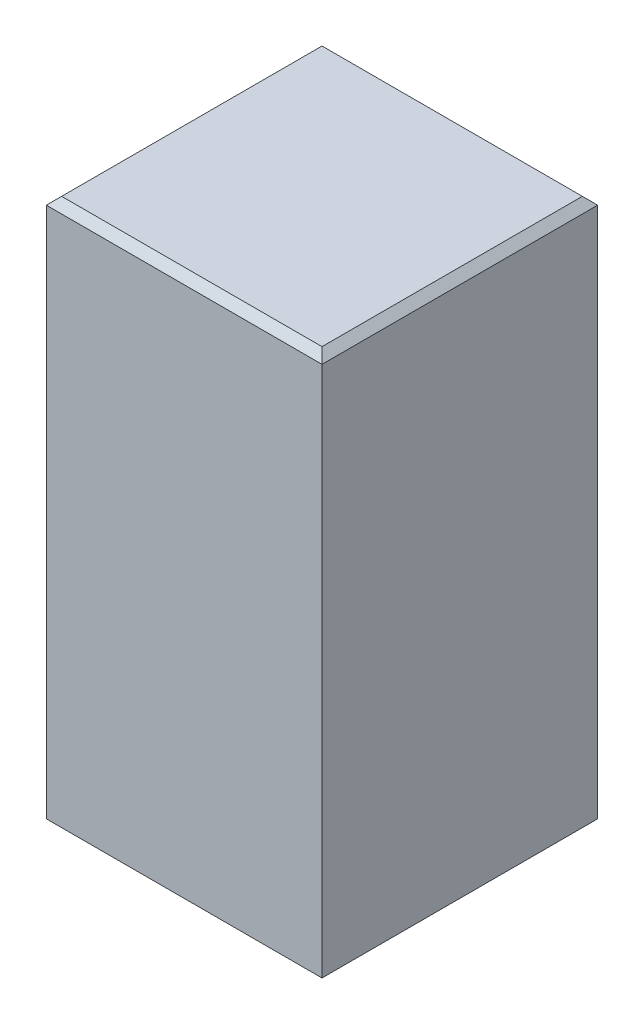
ISO-10303-21;
HEADER;
FILE_DESCRIPTION(('STEP AP214'),'2;1');
FILE_NAME('part.step','',(''),(''),'','','');
FILE_SCHEMA(('AUTOMOTIVE_DESIGN { 1 0 10303 214 1 1 1 1 }'));
ENDSEC;
DATA;
#1=APPLICATION_CONTEXT('core data for automotive mechanical design processes');
#2=APPLICATION_PROTOCOL_DEFINITION('international standard','automotive_design',2000,#1);
#3=PRODUCT_CONTEXT('',#1,'mechanical');
#4=PRODUCT('Part','Part','',(#3));
#5=PRODUCT_RELATED_PRODUCT_CATEGORY('part','',(#4));
#6=PRODUCT_DEFINITION_FORMATION('','',#4);
#7=PRODUCT_DEFINITION_CONTEXT('part definition',#1,'design');
#8=PRODUCT_DEFINITION('design','',#6,#7);
#9=PRODUCT_DEFINITION_SHAPE('','',#8);
#10=(LENGTH_UNIT() NAMED_UNIT(*) SI_UNIT(.MILLI.,.METRE.));
#11=(NAMED_UNIT(*) PLANE_ANGLE_UNIT() SI_UNIT($,.RADIAN.));
#12=(NAMED_UNIT(*) SI_UNIT($,.STERADIAN.) SOLID_ANGLE_UNIT());
#13=UNCERTAINTY_MEASURE_WITH_UNIT(LENGTH_MEASURE(1.E-05),#10,'distance_accuracy_value','');
#14=(GEOMETRIC_REPRESENTATION_CONTEXT(3) GLOBAL_UNCERTAINTY_ASSIGNED_CONTEXT((#13)) GLOBAL_UNIT_ASSIGNED_CONTEXT((#10,
#11,#12)) REPRESENTATION_CONTEXT('',''));
#15=CARTESIAN_POINT('',(0.,0.,0.));
#16=DIRECTION('',(0.,0.,1.));
#17=DIRECTION('',(1.,0.,0.));
#18=AXIS2_PLACEMENT_3D('',#15,#16,#17);
#19=CARTESIAN_POINT('',(0.,0.,0.));
#20=DIRECTION('',(0.,1.,0.));
#21=DIRECTION('',(0.,0.,1.));
#22=AXIS2_PLACEMENT_3D('',#19,#20,#21);
#23=PLANE('',#22);
#24=DIRECTION('',(0.,0.,1.));
#25=VECTOR('',#24,1.);
#26=CARTESIAN_POINT('',(-9.,0.,-9.));
#27=LINE('',#26,#25);
#28=CARTESIAN_POINT('',(-9.,0.,-9.));
#29=VERTEX_POINT('',#28);
#30=CARTESIAN_POINT('',(-9.,0.,9.));
#31=VERTEX_POINT('',#30);
#32=EDGE_CURVE('E148',#29,#31,#27,.T.);
#33=ORIENTED_EDGE('',*,*,#32,.F.);
#34=DIRECTION('',(-1.,0.,0.));
#35=VECTOR('',#34,1.);
#36=CARTESIAN_POINT('',(-9.,0.,-9.));
#37=LINE('',#36,#35);
#38=CARTESIAN_POINT('',(9.,0.,-9.));
#39=VERTEX_POINT('',#38);
#40=EDGE_CURVE('E165',#39,#29,#37,.T.);
#41=ORIENTED_EDGE('',*,*,#40,.F.);
#42=DIRECTION('',(0.,0.,-1.));
#43=VECTOR('',#42,1.);
#44=CARTESIAN_POINT('',(9.,0.,-9.));
#45=LINE('',#44,#43);
#46=CARTESIAN_POINT('',(9.00000000000001,0.,9.));
#47=VERTEX_POINT('',#46);
#48=EDGE_CURVE('E161',#47,#39,#45,.T.);
#49=ORIENTED_EDGE('',*,*,#48,.F.);
#50=DIRECTION('',(1.,0.,0.));
#51=VECTOR('',#50,1.);
#52=CARTESIAN_POINT('',(-9.,0.,9.));
#53=LINE('',#52,#51);
#54=EDGE_CURVE('E157',#31,#47,#53,.T.);
#55=ORIENTED_EDGE('',*,*,#54,.F.);
#56=EDGE_LOOP('',(#33,#41,#49,#55));
#57=FACE_BOUND('',#56,.T.);
#58=DIRECTION('',(0.,0.,1.));
#59=VECTOR('',#58,1.);
#60=CARTESIAN_POINT('',(-8.2,0.,-8.2));
#61=LINE('',#60,#59);
#62=CARTESIAN_POINT('',(-8.2,0.,-8.2));
#63=VERTEX_POINT('',#62);
#64=CARTESIAN_POINT('',(-8.19999999999999,0.,8.2));
#65=VERTEX_POINT('',#64);
#66=EDGE_CURVE('E216',#63,#65,#61,.T.);
#67=ORIENTED_EDGE('',*,*,#66,.T.);
#68=DIRECTION('',(1.,0.,0.));
#69=VECTOR('',#68,1.);
#70=CARTESIAN_POINT('',(-8.19999999999999,0.,8.2));
#71=LINE('',#70,#69);
#72=CARTESIAN_POINT('',(8.2,0.,8.2));
#73=VERTEX_POINT('',#72);
#74=EDGE_CURVE('E222',#65,#73,#71,.T.);
#75=ORIENTED_EDGE('',*,*,#74,.T.);
#76=DIRECTION('',(0.,0.,-1.));
#77=VECTOR('',#76,1.);
#78=CARTESIAN_POINT('',(8.2,0.,-8.2));
#79=LINE('',#78,#77);
#80=CARTESIAN_POINT('',(8.2,0.,-8.2));
#81=VERTEX_POINT('',#80);
#82=EDGE_CURVE('E141',#73,#81,#79,.T.);
#83=ORIENTED_EDGE('',*,*,#82,.T.);
#84=DIRECTION('',(-1.,0.,0.));
#85=VECTOR('',#84,1.);
#86=CARTESIAN_POINT('',(-8.2,0.,-8.2));
#87=LINE('',#86,#85);
#88=EDGE_CURVE('E232',#81,#63,#87,.T.);
#89=ORIENTED_EDGE('',*,*,#88,.T.);
#90=EDGE_LOOP('',(#67,#75,#83,#89));
#91=FACE_BOUND('',#90,.T.);
#92=ADVANCED_FACE('F39',(#57,#91),#23,.F.);
#93=CARTESIAN_POINT('',(-9.,34.,-9.));
#94=DIRECTION('',(1.,0.,0.));
#95=DIRECTION('',(0.,0.,-1.));
#96=AXIS2_PLACEMENT_3D('',#93,#94,#95);
#97=PLANE('',#96);
#98=DIRECTION('',(0.,-1.,0.));
#99=VECTOR('',#98,1.);
#100=CARTESIAN_POINT('',(-9.,34.,9.));
#101=LINE('',#100,#99);
#102=CARTESIAN_POINT('',(-9.,34.7,9.));
#103=VERTEX_POINT('',#102);
#104=EDGE_CURVE('E178',#103,#31,#101,.T.);
#105=ORIENTED_EDGE('',*,*,#104,.F.);
#106=DIRECTION('',(0.,0.,-1.));
#107=VECTOR('',#106,1.);
#108=CARTESIAN_POINT('',(-9.,34.7,-9.));
#109=LINE('',#108,#107);
#110=CARTESIAN_POINT('',(-9.,34.7,-9.));
#111=VERTEX_POINT('',#110);
#112=EDGE_CURVE('E194',#103,#111,#109,.T.);
#113=ORIENTED_EDGE('',*,*,#112,.T.);
#114=DIRECTION('',(0.,-1.,0.));
#115=VECTOR('',#114,1.);
#116=CARTESIAN_POINT('',(-9.,34.,-9.));
#117=LINE('',#116,#115);
#118=EDGE_CURVE('E169',#111,#29,#117,.T.);
#119=ORIENTED_EDGE('',*,*,#118,.T.);
#120=ORIENTED_EDGE('',*,*,#32,.T.);
#121=EDGE_LOOP('',(#105,#113,#119,#120));
#122=FACE_BOUND('',#121,.T.);
#123=ADVANCED_FACE('F257',(#122),#97,.F.);
#124=CARTESIAN_POINT('',(-9.,34.,9.));
#125=DIRECTION('',(0.,0.,-1.));
#126=DIRECTION('',(-1.,0.,0.));
#127=AXIS2_PLACEMENT_3D('',#124,#125,#126);
#128=PLANE('',#127);
#129=DIRECTION('',(0.,-1.,0.));
#130=VECTOR('',#129,1.);
#131=CARTESIAN_POINT('',(9.00000000000001,34.,9.));
#132=LINE('',#131,#130);
#133=CARTESIAN_POINT('',(9.00000000000001,34.7,9.));
#134=VERTEX_POINT('',#133);
#135=EDGE_CURVE('E175',#134,#47,#132,.T.);
#136=ORIENTED_EDGE('',*,*,#135,.F.);
#137=DIRECTION('',(-1.,0.,0.));
#138=VECTOR('',#137,1.);
#139=CARTESIAN_POINT('',(-9.,34.7,9.));
#140=LINE('',#139,#138);
#141=EDGE_CURVE('E11',#134,#103,#140,.T.);
#142=ORIENTED_EDGE('',*,*,#141,.T.);
#143=ORIENTED_EDGE('',*,*,#104,.T.);
#144=ORIENTED_EDGE('',*,*,#54,.T.);
#145=EDGE_LOOP('',(#136,#142,#143,#144));
#146=FACE_BOUND('',#145,.T.);
#147=ADVANCED_FACE('F262',(#146),#128,.F.);
#148=CARTESIAN_POINT('',(9.,34.,-9.));
#149=DIRECTION('',(-1.,0.,0.));
#150=DIRECTION('',(0.,0.,1.));
#151=AXIS2_PLACEMENT_3D('',#148,#149,#150);
#152=PLANE('',#151);
#153=DIRECTION('',(0.,-1.,0.));
#154=VECTOR('',#153,1.);
#155=CARTESIAN_POINT('',(9.,34.,-9.));
#156=LINE('',#155,#154);
#157=CARTESIAN_POINT('',(9.,34.7,-9.));
#158=VERTEX_POINT('',#157);
#159=EDGE_CURVE('E172',#158,#39,#156,.T.);
#160=ORIENTED_EDGE('',*,*,#159,.F.);
#161=DIRECTION('',(0.,0.,1.));
#162=VECTOR('',#161,1.);
#163=CARTESIAN_POINT('',(9.00000000000001,34.7,9.));
#164=LINE('',#163,#162);
#165=EDGE_CURVE('E49',#158,#134,#164,.T.);
#166=ORIENTED_EDGE('',*,*,#165,.T.);
#167=ORIENTED_EDGE('',*,*,#135,.T.);
#168=ORIENTED_EDGE('',*,*,#48,.T.);
#169=EDGE_LOOP('',(#160,#166,#167,#168));
#170=FACE_BOUND('',#169,.T.);
#171=ADVANCED_FACE('F253',(#170),#152,.F.);
#172=CARTESIAN_POINT('',(-9.,34.,-9.));
#173=DIRECTION('',(0.,0.,1.));
#174=DIRECTION('',(1.,0.,0.));
#175=AXIS2_PLACEMENT_3D('',#172,#173,#174);
#176=PLANE('',#175);
#177=ORIENTED_EDGE('',*,*,#118,.F.);
#178=DIRECTION('',(1.,0.,0.));
#179=VECTOR('',#178,1.);
#180=CARTESIAN_POINT('',(9.00000000000001,34.7,-9.));
#181=LINE('',#180,#179);
#182=EDGE_CURVE('E64',#111,#158,#181,.T.);
#183=ORIENTED_EDGE('',*,*,#182,.T.);
#184=ORIENTED_EDGE('',*,*,#159,.T.);
#185=ORIENTED_EDGE('',*,*,#40,.T.);
#186=EDGE_LOOP('',(#177,#183,#184,#185));
#187=FACE_BOUND('',#186,.T.);
#188=ADVANCED_FACE('F246',(#187),#176,.F.);
#189=CARTESIAN_POINT('',(-8.2,34.,-8.2));
#190=DIRECTION('',(1.,0.,0.));
#191=DIRECTION('',(0.,0.,-1.));
#192=AXIS2_PLACEMENT_3D('',#189,#190,#191);
#193=PLANE('',#192);
#194=ORIENTED_EDGE('',*,*,#66,.F.);
#195=DIRECTION('',(0.,-1.,0.));
#196=VECTOR('',#195,1.);
#197=CARTESIAN_POINT('',(-8.2,34.,-8.2));
#198=LINE('',#197,#196);
#199=CARTESIAN_POINT('',(-8.2,34.,-8.2));
#200=VERTEX_POINT('',#199);
#201=EDGE_CURVE('E150',#200,#63,#198,.T.);
#202=ORIENTED_EDGE('',*,*,#201,.F.);
#203=DIRECTION('',(0.,0.,1.));
#204=VECTOR('',#203,1.);
#205=CARTESIAN_POINT('',(-8.2,34.,-8.2));
#206=LINE('',#205,#204);
#207=CARTESIAN_POINT('',(-8.19999999999999,34.,8.2));
#208=VERTEX_POINT('',#207);
#209=EDGE_CURVE('E137',#200,#208,#206,.T.);
#210=ORIENTED_EDGE('',*,*,#209,.T.);
#211=DIRECTION('',(0.,-1.,0.));
#212=VECTOR('',#211,1.);
#213=CARTESIAN_POINT('',(-8.19999999999999,34.,8.2));
#214=LINE('',#213,#212);
#215=EDGE_CURVE('E135',#208,#65,#214,.T.);
#216=ORIENTED_EDGE('',*,*,#215,.T.);
#217=EDGE_LOOP('',(#194,#202,#210,#216));
#218=FACE_BOUND('',#217,.T.);
#219=ADVANCED_FACE('F242',(#218),#193,.T.);
#220=CARTESIAN_POINT('',(-8.19999999999999,34.,8.2));
#221=DIRECTION('',(0.,0.,-1.));
#222=DIRECTION('',(-1.,0.,0.));
#223=AXIS2_PLACEMENT_3D('',#220,#221,#222);
#224=PLANE('',#223);
#225=ORIENTED_EDGE('',*,*,#74,.F.);
#226=ORIENTED_EDGE('',*,*,#215,.F.);
#227=DIRECTION('',(1.,0.,0.));
#228=VECTOR('',#227,1.);
#229=CARTESIAN_POINT('',(-8.19999999999999,34.,8.2));
#230=LINE('',#229,#228);
#231=CARTESIAN_POINT('',(8.2,34.,8.2));
#232=VERTEX_POINT('',#231);
#233=EDGE_CURVE('E120',#208,#232,#230,.T.);
#234=ORIENTED_EDGE('',*,*,#233,.T.);
#235=DIRECTION('',(0.,-1.,0.));
#236=VECTOR('',#235,1.);
#237=CARTESIAN_POINT('',(8.2,34.,8.2));
#238=LINE('',#237,#236);
#239=EDGE_CURVE('E132',#232,#73,#238,.T.);
#240=ORIENTED_EDGE('',*,*,#239,.T.);
#241=EDGE_LOOP('',(#225,#226,#234,#240));
#242=FACE_BOUND('',#241,.T.);
#243=ADVANCED_FACE('F131',(#242),#224,.T.);
#244=CARTESIAN_POINT('',(8.2,34.,-8.2));
#245=DIRECTION('',(-1.,0.,0.));
#246=DIRECTION('',(0.,0.,1.));
#247=AXIS2_PLACEMENT_3D('',#244,#245,#246);
#248=PLANE('',#247);
#249=ORIENTED_EDGE('',*,*,#82,.F.);
#250=ORIENTED_EDGE('',*,*,#239,.F.);
#251=DIRECTION('',(0.,0.,-1.));
#252=VECTOR('',#251,1.);
#253=CARTESIAN_POINT('',(8.2,34.,-8.2));
#254=LINE('',#253,#252);
#255=CARTESIAN_POINT('',(8.2,34.,-8.2));
#256=VERTEX_POINT('',#255);
#257=EDGE_CURVE('E117',#232,#256,#254,.T.);
#258=ORIENTED_EDGE('',*,*,#257,.T.);
#259=DIRECTION('',(0.,-1.,0.));
#260=VECTOR('',#259,1.);
#261=CARTESIAN_POINT('',(8.2,34.,-8.2));
#262=LINE('',#261,#260);
#263=EDGE_CURVE('E144',#256,#81,#262,.T.);
#264=ORIENTED_EDGE('',*,*,#263,.T.);
#265=EDGE_LOOP('',(#249,#250,#258,#264));
#266=FACE_BOUND('',#265,.T.);
#267=ADVANCED_FACE('F139',(#266),#248,.T.);
#268=CARTESIAN_POINT('',(-8.2,34.,-8.2));
#269=DIRECTION('',(0.,0.,1.));
#270=DIRECTION('',(1.,0.,0.));
#271=AXIS2_PLACEMENT_3D('',#268,#269,#270);
#272=PLANE('',#271);
#273=ORIENTED_EDGE('',*,*,#88,.F.);
#274=ORIENTED_EDGE('',*,*,#263,.F.);
#275=DIRECTION('',(-1.,0.,0.));
#276=VECTOR('',#275,1.);
#277=CARTESIAN_POINT('',(-8.2,34.,-8.2));
#278=LINE('',#277,#276);
#279=EDGE_CURVE('E123',#256,#200,#278,.T.);
#280=ORIENTED_EDGE('',*,*,#279,.T.);
#281=ORIENTED_EDGE('',*,*,#201,.T.);
#282=EDGE_LOOP('',(#273,#274,#280,#281));
#283=FACE_BOUND('',#282,.T.);
#284=ADVANCED_FACE('F240',(#283),#272,.T.);
#285=CARTESIAN_POINT('',(0.,34.,0.));
#286=DIRECTION('',(0.,1.,0.));
#287=DIRECTION('',(0.,0.,1.));
#288=AXIS2_PLACEMENT_3D('',#285,#286,#287);
#289=PLANE('',#288);
#290=ORIENTED_EDGE('',*,*,#233,.F.);
#291=ORIENTED_EDGE('',*,*,#209,.F.);
#292=ORIENTED_EDGE('',*,*,#279,.F.);
#293=ORIENTED_EDGE('',*,*,#257,.F.);
#294=EDGE_LOOP('',(#290,#291,#292,#293));
#295=FACE_BOUND('',#294,.T.);
#296=ADVANCED_FACE('F119',(#295),#289,.F.);
#297=CARTESIAN_POINT('',(0.,35.2,0.));
#298=DIRECTION('',(0.,1.,0.));
#299=DIRECTION('',(0.,0.,1.));
#300=AXIS2_PLACEMENT_3D('',#297,#298,#299);
#301=PLANE('',#300);
#302=DIRECTION('',(-1.,0.,0.));
#303=VECTOR('',#302,1.);
#304=CARTESIAN_POINT('',(-9.,35.2,-8.49999999999999));
#305=LINE('',#304,#303);
#306=CARTESIAN_POINT('',(8.49999999999999,35.2,-8.49999999999999));
#307=VERTEX_POINT('',#306);
#308=CARTESIAN_POINT('',(-8.49999999999999,35.2,-8.49999999999999));
#309=VERTEX_POINT('',#308);
#310=EDGE_CURVE('E187',#307,#309,#305,.T.);
#311=ORIENTED_EDGE('',*,*,#310,.T.);
#312=DIRECTION('',(0.,0.,1.));
#313=VECTOR('',#312,1.);
#314=CARTESIAN_POINT('',(-8.49999999999999,35.2,9.));
#315=LINE('',#314,#313);
#316=CARTESIAN_POINT('',(-8.49999999999999,35.2,8.49999999999999));
#317=VERTEX_POINT('',#316);
#318=EDGE_CURVE('E190',#309,#317,#315,.T.);
#319=ORIENTED_EDGE('',*,*,#318,.T.);
#320=DIRECTION('',(1.,0.,0.));
#321=VECTOR('',#320,1.);
#322=CARTESIAN_POINT('',(9.00000000000001,35.2,8.49999999999999));
#323=LINE('',#322,#321);
#324=CARTESIAN_POINT('',(8.5,35.2,8.49999999999999));
#325=VERTEX_POINT('',#324);
#326=EDGE_CURVE('E181',#317,#325,#323,.T.);
#327=ORIENTED_EDGE('',*,*,#326,.T.);
#328=DIRECTION('',(0.,0.,-1.));
#329=VECTOR('',#328,1.);
#330=CARTESIAN_POINT('',(8.49999999999999,35.2,-9.));
#331=LINE('',#330,#329);
#332=EDGE_CURVE('E184',#325,#307,#331,.T.);
#333=ORIENTED_EDGE('',*,*,#332,.T.);
#334=EDGE_LOOP('',(#311,#319,#327,#333));
#335=FACE_BOUND('',#334,.T.);
#336=ADVANCED_FACE('F283',(#335),#301,.T.);
#337=CARTESIAN_POINT('',(8.5,35.2,0.));
#338=DIRECTION('',(0.70710678118655,0.707106781186545,0.));
#339=DIRECTION('',(0.,0.,1.));
#340=AXIS2_PLACEMENT_3D('',#337,#338,#339);
#341=PLANE('',#340);
#342=DIRECTION('',(-0.577350269189625,0.577350269189629,-0.577350269189624));
#343=VECTOR('',#342,1.);
#344=CARTESIAN_POINT('',(5.66666666666668,38.0333333333334,5.66666666666667));
#345=LINE('',#344,#343);
#346=EDGE_CURVE('E207',#134,#325,#345,.T.);
#347=ORIENTED_EDGE('',*,*,#346,.F.);
#348=ORIENTED_EDGE('',*,*,#165,.F.);
#349=DIRECTION('',(-0.577350269189624,0.577350269189628,0.577350269189625));
#350=VECTOR('',#349,1.);
#351=CARTESIAN_POINT('',(5.66666666666668,38.0333333333333,-5.66666666666667));
#352=LINE('',#351,#350);
#353=EDGE_CURVE('E43',#307,#158,#352,.F.);
#354=ORIENTED_EDGE('',*,*,#353,.F.);
#355=ORIENTED_EDGE('',*,*,#332,.F.);
#356=EDGE_LOOP('',(#347,#348,#354,#355));
#357=FACE_BOUND('',#356,.T.);
#358=ADVANCED_FACE('F41',(#357),#341,.T.);
#359=CARTESIAN_POINT('',(0.,35.2,-8.49999999999999));
#360=DIRECTION('',(0.,0.707106781186546,-0.707106781186549));
#361=DIRECTION('',(1.,0.,0.));
#362=AXIS2_PLACEMENT_3D('',#359,#360,#361);
#363=PLANE('',#362);
#364=ORIENTED_EDGE('',*,*,#353,.T.);
#365=ORIENTED_EDGE('',*,*,#182,.F.);
#366=DIRECTION('',(0.577350269189624,0.577350269189628,0.577350269189625));
#367=VECTOR('',#366,1.);
#368=CARTESIAN_POINT('',(-5.66666666666668,38.0333333333333,-5.66666666666667));
#369=LINE('',#368,#367);
#370=EDGE_CURVE('E205',#309,#111,#369,.F.);
#371=ORIENTED_EDGE('',*,*,#370,.F.);
#372=ORIENTED_EDGE('',*,*,#310,.F.);
#373=EDGE_LOOP('',(#364,#365,#371,#372));
#374=FACE_BOUND('',#373,.T.);
#375=ADVANCED_FACE('F278',(#374),#363,.T.);
#376=CARTESIAN_POINT('',(0.,35.2,8.49999999999999));
#377=DIRECTION('',(0.,0.707106781186544,0.707106781186551));
#378=DIRECTION('',(-1.,0.,0.));
#379=AXIS2_PLACEMENT_3D('',#376,#377,#378);
#380=PLANE('',#379);
#381=ORIENTED_EDGE('',*,*,#346,.T.);
#382=ORIENTED_EDGE('',*,*,#326,.F.);
#383=DIRECTION('',(-0.577350269189625,-0.577350269189629,0.577350269189624));
#384=VECTOR('',#383,1.);
#385=CARTESIAN_POINT('',(-5.66666666666667,38.0333333333333,5.66666666666668));
#386=LINE('',#385,#384);
#387=EDGE_CURVE('E202',#103,#317,#386,.F.);
#388=ORIENTED_EDGE('',*,*,#387,.F.);
#389=ORIENTED_EDGE('',*,*,#141,.F.);
#390=EDGE_LOOP('',(#381,#382,#388,#389));
#391=FACE_BOUND('',#390,.T.);
#392=ADVANCED_FACE('F275',(#391),#380,.T.);
#393=CARTESIAN_POINT('',(-8.49999999999999,35.2,0.));
#394=DIRECTION('',(-0.70710678118655,0.707106781186545,0.));
#395=DIRECTION('',(0.,0.,-1.));
#396=AXIS2_PLACEMENT_3D('',#393,#394,#395);
#397=PLANE('',#396);
#398=ORIENTED_EDGE('',*,*,#370,.T.);
#399=ORIENTED_EDGE('',*,*,#112,.F.);
#400=ORIENTED_EDGE('',*,*,#387,.T.);
#401=ORIENTED_EDGE('',*,*,#318,.F.);
#402=EDGE_LOOP('',(#398,#399,#400,#401));
#403=FACE_BOUND('',#402,.T.);
#404=ADVANCED_FACE('F272',(#403),#397,.T.);
#405=CLOSED_SHELL('',(#92,#123,#147,#171,#188,#219,#243,#267,#284,#296,#336,#358,#375,#392,#404));
#406=MANIFOLD_SOLID_BREP('B2',#405);
#407=ADVANCED_BREP_SHAPE_REPRESENTATION('',(#18,#406),#14);
#408=SHAPE_DEFINITION_REPRESENTATION(#9,#407);
ENDSEC;
END-ISO-10303-21;
